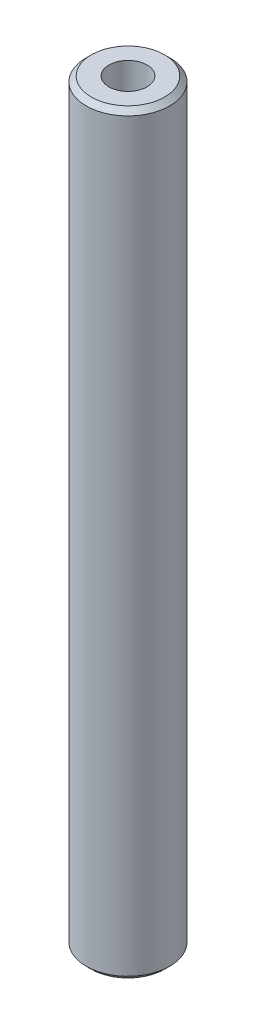
ISO-10303-21;
HEADER;
FILE_DESCRIPTION(('STEP AP214'),'2;1');
FILE_NAME('part.step','',(''),(''),'','','');
FILE_SCHEMA(('AUTOMOTIVE_DESIGN { 1 0 10303 214 1 1 1 1 }'));
ENDSEC;
DATA;
#1=APPLICATION_CONTEXT('core data for automotive mechanical design processes');
#2=APPLICATION_PROTOCOL_DEFINITION('international standard','automotive_design',2000,#1);
#3=PRODUCT_CONTEXT('',#1,'mechanical');
#4=PRODUCT('Part','Part','',(#3));
#5=PRODUCT_RELATED_PRODUCT_CATEGORY('part','',(#4));
#6=PRODUCT_DEFINITION_FORMATION('','',#4);
#7=PRODUCT_DEFINITION_CONTEXT('part definition',#1,'design');
#8=PRODUCT_DEFINITION('design','',#6,#7);
#9=PRODUCT_DEFINITION_SHAPE('','',#8);
#10=(LENGTH_UNIT() NAMED_UNIT(*) SI_UNIT(.MILLI.,.METRE.));
#11=(NAMED_UNIT(*) PLANE_ANGLE_UNIT() SI_UNIT($,.RADIAN.));
#12=(NAMED_UNIT(*) SI_UNIT($,.STERADIAN.) SOLID_ANGLE_UNIT());
#13=UNCERTAINTY_MEASURE_WITH_UNIT(LENGTH_MEASURE(1.E-05),#10,'distance_accuracy_value','');
#14=(GEOMETRIC_REPRESENTATION_CONTEXT(3) GLOBAL_UNCERTAINTY_ASSIGNED_CONTEXT((#13)) GLOBAL_UNIT_ASSIGNED_CONTEXT((#10,
#11,#12)) REPRESENTATION_CONTEXT('',''));
#15=CARTESIAN_POINT('',(0.,0.,0.));
#16=DIRECTION('',(0.,0.,1.));
#17=DIRECTION('',(1.,0.,0.));
#18=AXIS2_PLACEMENT_3D('',#15,#16,#17);
#19=CARTESIAN_POINT('',(0.,90.4105520086861,0.));
#20=DIRECTION('',(0.,-1.,0.));
#21=DIRECTION('',(0.,0.,-1.));
#22=AXIS2_PLACEMENT_3D('',#19,#20,#21);
#23=CYLINDRICAL_SURFACE('',#22,5.);
#24=CARTESIAN_POINT('',(0.,89.7965118532664,0.));
#25=DIRECTION('',(0.,1.,0.));
#26=DIRECTION('',(0.,0.,1.));
#27=AXIS2_PLACEMENT_3D('',#24,#25,#26);
#28=CIRCLE('',#27,5.);
#29=CARTESIAN_POINT('',(0.,89.7965118532664,5.));
#30=VERTEX_POINT('',#29);
#31=EDGE_CURVE('E50',#30,#30,#28,.F.);
#32=ORIENTED_EDGE('',*,*,#31,.T.);
#33=EDGE_LOOP('',(#32));
#34=FACE_BOUND('',#33,.T.);
#35=CARTESIAN_POINT('',(0.,0.614040155419673,0.));
#36=DIRECTION('',(0.,1.,0.));
#37=DIRECTION('',(0.,0.,1.));
#38=AXIS2_PLACEMENT_3D('',#35,#36,#37);
#39=CIRCLE('',#38,5.);
#40=CARTESIAN_POINT('',(0.,0.614040155419673,5.));
#41=VERTEX_POINT('',#40);
#42=EDGE_CURVE('E51',#41,#41,#39,.T.);
#43=ORIENTED_EDGE('',*,*,#42,.T.);
#44=EDGE_LOOP('',(#43));
#45=FACE_BOUND('',#44,.T.);
#46=ADVANCED_FACE('F39',(#34,#45),#23,.T.);
#47=CARTESIAN_POINT('',(0.,90.4105520086861,0.));
#48=DIRECTION('',(0.,1.,0.));
#49=DIRECTION('',(0.,0.,1.));
#50=AXIS2_PLACEMENT_3D('',#47,#48,#49);
#51=PLANE('',#50);
#52=CARTESIAN_POINT('',(0.,90.4105520086861,0.));
#53=DIRECTION('',(0.,1.,0.));
#54=DIRECTION('',(0.,0.,1.));
#55=AXIS2_PLACEMENT_3D('',#52,#53,#54);
#56=CIRCLE('',#55,4.38595984458036);
#57=CARTESIAN_POINT('',(0.,90.4105520086861,4.38595984458036));
#58=VERTEX_POINT('',#57);
#59=EDGE_CURVE('E54',#58,#58,#56,.T.);
#60=ORIENTED_EDGE('',*,*,#59,.T.);
#61=EDGE_LOOP('',(#60));
#62=FACE_BOUND('',#61,.T.);
#63=CARTESIAN_POINT('',(0.,90.4105520086861,0.));
#64=DIRECTION('',(0.,1.,0.));
#65=DIRECTION('',(0.,0.,1.));
#66=AXIS2_PLACEMENT_3D('',#63,#64,#65);
#67=CIRCLE('',#66,2.27778302262453);
#68=CARTESIAN_POINT('',(0.,90.4105520086861,2.27778302262453));
#69=VERTEX_POINT('',#68);
#70=EDGE_CURVE('E58',#69,#69,#67,.T.);
#71=ORIENTED_EDGE('',*,*,#70,.F.);
#72=EDGE_LOOP('',(#71));
#73=FACE_BOUND('',#72,.T.);
#74=ADVANCED_FACE('F69',(#62,#73),#51,.T.);
#75=CARTESIAN_POINT('',(0.,0.,0.));
#76=DIRECTION('',(0.,1.,0.));
#77=DIRECTION('',(0.,0.,1.));
#78=AXIS2_PLACEMENT_3D('',#75,#76,#77);
#79=PLANE('',#78);
#80=CARTESIAN_POINT('',(0.,0.,0.));
#81=DIRECTION('',(0.,1.,0.));
#82=DIRECTION('',(0.,0.,1.));
#83=AXIS2_PLACEMENT_3D('',#80,#81,#82);
#84=CIRCLE('',#83,4.38595984458032);
#85=CARTESIAN_POINT('',(0.,0.,4.38595984458032));
#86=VERTEX_POINT('',#85);
#87=EDGE_CURVE('E10',#86,#86,#84,.F.);
#88=ORIENTED_EDGE('',*,*,#87,.T.);
#89=EDGE_LOOP('',(#88));
#90=FACE_BOUND('',#89,.T.);
#91=CARTESIAN_POINT('',(0.,0.,0.));
#92=DIRECTION('',(0.,1.,0.));
#93=DIRECTION('',(0.,0.,1.));
#94=AXIS2_PLACEMENT_3D('',#91,#92,#93);
#95=CIRCLE('',#94,2.27778302262453);
#96=CARTESIAN_POINT('',(0.,0.,2.27778302262453));
#97=VERTEX_POINT('',#96);
#98=EDGE_CURVE('E63',#97,#97,#95,.T.);
#99=ORIENTED_EDGE('',*,*,#98,.T.);
#100=EDGE_LOOP('',(#99));
#101=FACE_BOUND('',#100,.T.);
#102=ADVANCED_FACE('F75',(#90,#101),#79,.F.);
#103=CARTESIAN_POINT('',(0.,90.4105520086861,0.));
#104=DIRECTION('',(0.,-1.,0.));
#105=DIRECTION('',(0.,0.,-1.));
#106=AXIS2_PLACEMENT_3D('',#103,#104,#105);
#107=CYLINDRICAL_SURFACE('',#106,2.27778302262453);
#108=ORIENTED_EDGE('',*,*,#70,.T.);
#109=EDGE_LOOP('',(#108));
#110=FACE_BOUND('',#109,.T.);
#111=ORIENTED_EDGE('',*,*,#98,.F.);
#112=EDGE_LOOP('',(#111));
#113=FACE_BOUND('',#112,.T.);
#114=ADVANCED_FACE('F70',(#110,#113),#107,.F.);
#115=CARTESIAN_POINT('',(0.,90.4105520086861,0.));
#116=DIRECTION('',(0.,-1.,0.));
#117=DIRECTION('',(0.,0.,-1.));
#118=AXIS2_PLACEMENT_3D('',#115,#116,#117);
#119=CONICAL_SURFACE('',#118,4.38595984458036,0.785398163397434);
#120=ORIENTED_EDGE('',*,*,#31,.F.);
#121=EDGE_LOOP('',(#120));
#122=FACE_BOUND('',#121,.T.);
#123=ORIENTED_EDGE('',*,*,#59,.F.);
#124=EDGE_LOOP('',(#123));
#125=FACE_BOUND('',#124,.T.);
#126=ADVANCED_FACE('F81',(#122,#125),#119,.T.);
#127=CARTESIAN_POINT('',(0.,0.614040155419673,0.));
#128=DIRECTION('',(0.,1.,0.));
#129=DIRECTION('',(0.,0.,1.));
#130=AXIS2_PLACEMENT_3D('',#127,#128,#129);
#131=CONICAL_SURFACE('',#130,5.,0.785398163397456);
#132=CARTESIAN_POINT('',(0.,0.,4.38595984458032));
#133=CARTESIAN_POINT('',(0.,0.00639625161895462,4.39235609619927));
#134=CARTESIAN_POINT('',(0.,0.0127925032379096,4.39875234781823));
#135=CARTESIAN_POINT('',(0.,0.0255850064758196,4.41154485105614));
#136=CARTESIAN_POINT('',(0.,0.0319812580947746,4.41794110267509));
#137=CARTESIAN_POINT('',(0.,0.0447737613326845,4.430733605913));
#138=CARTESIAN_POINT('',(0.,0.0511700129516394,4.43712985753196));
#139=CARTESIAN_POINT('',(0.,0.0639625161895492,4.44992236076987));
#140=CARTESIAN_POINT('',(0.,0.0703587678085041,4.45631861238882));
#141=CARTESIAN_POINT('',(0.,0.083151271046414,4.46911111562673));
#142=CARTESIAN_POINT('',(0.,0.0895475226653689,4.47550736724569));
#143=CARTESIAN_POINT('',(0.,0.102340025903279,4.4882998704836));
#144=CARTESIAN_POINT('',(0.,0.108736277522234,4.49469612210255));
#145=CARTESIAN_POINT('',(0.,0.121528780760144,4.50748862534046));
#146=CARTESIAN_POINT('',(0.,0.127925032379099,4.51388487695942));
#147=CARTESIAN_POINT('',(0.,0.140717535617008,4.52667738019733));
#148=CARTESIAN_POINT('',(0.,0.147113787235963,4.53307363181628));
#149=CARTESIAN_POINT('',(0.,0.159906290473873,4.54586613505419));
#150=CARTESIAN_POINT('',(0.,0.166302542092828,4.55226238667315));
#151=CARTESIAN_POINT('',(0.,0.179095045330738,4.56505488991106));
#152=CARTESIAN_POINT('',(0.,0.185491296949693,4.57145114153001));
#153=CARTESIAN_POINT('',(0.,0.198283800187603,4.58424364476792));
#154=CARTESIAN_POINT('',(0.,0.204680051806558,4.59063989638688));
#155=CARTESIAN_POINT('',(0.,0.217472555044468,4.60343239962479));
#156=CARTESIAN_POINT('',(0.,0.223868806663423,4.60982865124374));
#157=CARTESIAN_POINT('',(0.,0.236661309901332,4.62262115448165));
#158=CARTESIAN_POINT('',(0.,0.243057561520287,4.62901740610061));
#159=CARTESIAN_POINT('',(0.,0.255850064758197,4.64180990933852));
#160=CARTESIAN_POINT('',(0.,0.262246316377152,4.64820616095747));
#161=CARTESIAN_POINT('',(0.,0.275038819615062,4.66099866419538));
#162=CARTESIAN_POINT('',(0.,0.281435071234017,4.66739491581434));
#163=CARTESIAN_POINT('',(0.,0.294227574471927,4.68018741905225));
#164=CARTESIAN_POINT('',(0.,0.300623826090882,4.6865836706712));
#165=CARTESIAN_POINT('',(0.,0.313416329328792,4.69937617390911));
#166=CARTESIAN_POINT('',(0.,0.319812580947747,4.70577242552807));
#167=CARTESIAN_POINT('',(0.,0.332605084185656,4.71856492876598));
#168=CARTESIAN_POINT('',(0.,0.339001335804611,4.72496118038493));
#169=CARTESIAN_POINT('',(0.,0.351793839042521,4.73775368362284));
#170=CARTESIAN_POINT('',(0.,0.358190090661476,4.7441499352418));
#171=CARTESIAN_POINT('',(0.,0.370982593899386,4.75694243847971));
#172=CARTESIAN_POINT('',(0.,0.377378845518341,4.76333869009866));
#173=CARTESIAN_POINT('',(0.,0.390171348756251,4.77613119333657));
#174=CARTESIAN_POINT('',(0.,0.396567600375206,4.78252744495553));
#175=CARTESIAN_POINT('',(0.,0.409360103613116,4.79531994819344));
#176=CARTESIAN_POINT('',(0.,0.415756355232071,4.80171619981239));
#177=CARTESIAN_POINT('',(0.,0.42854885846998,4.8145087030503));
#178=CARTESIAN_POINT('',(0.,0.434945110088935,4.82090495466926));
#179=CARTESIAN_POINT('',(0.,0.447737613326845,4.83369745790717));
#180=CARTESIAN_POINT('',(0.,0.4541338649458,4.84009370952612));
#181=CARTESIAN_POINT('',(0.,0.46692636818371,4.85288621276403));
#182=CARTESIAN_POINT('',(0.,0.473322619802665,4.85928246438299));
#183=CARTESIAN_POINT('',(0.,0.486115123040575,4.8720749676209));
#184=CARTESIAN_POINT('',(0.,0.49251137465953,4.87847121923985));
#185=CARTESIAN_POINT('',(0.,0.50530387789744,4.89126372247777));
#186=CARTESIAN_POINT('',(0.,0.511700129516395,4.89765997409672));
#187=CARTESIAN_POINT('',(0.,0.524492632754304,4.91045247733463));
#188=CARTESIAN_POINT('',(0.,0.530888884373259,4.91684872895358));
#189=CARTESIAN_POINT('',(0.,0.543681387611169,4.92964123219149));
#190=CARTESIAN_POINT('',(0.,0.550077639230124,4.93603748381045));
#191=CARTESIAN_POINT('',(0.,0.562870142468034,4.94882998704836));
#192=CARTESIAN_POINT('',(0.,0.569266394086989,4.95522623866731));
#193=CARTESIAN_POINT('',(0.,0.582058897324899,4.96801874190523));
#194=CARTESIAN_POINT('',(0.,0.588455148943854,4.97441499352418));
#195=CARTESIAN_POINT('',(0.,0.601247652181764,4.98720749676209));
#196=CARTESIAN_POINT('',(0.,0.607643903800718,4.99360374838104));
#197=CARTESIAN_POINT('',(0.,0.614040155419673,5.));
#198=B_SPLINE_CURVE_WITH_KNOTS('',3,(#132,#133,#134,#135,#136,#137,#138,#139,#140,#141,#142,
#143,#144,#145,#146,#147,#148,#149,#150,#151,#152,#153,#154,#155,#156,#157,#158,#159,#160,#161,
#162,#163,#164,#165,#166,#167,#168,#169,#170,#171,#172,#173,#174,#175,#176,#177,#178,#179,#180,
#181,#182,#183,#184,#185,#186,#187,#188,#189,#190,#191,#192,#193,#194,#195,#196,#197),
.UNSPECIFIED.,.F.,.F.,(4,2,2,2,2,2,2,2,2,2,2,2,2,2,2,2,2,2,2,2,2,2,2,2,2,2,2,2,2,2,2,2,4),(0.,
0.0271369973636311,0.0542739947272616,0.0814109920908927,0.108547989454524,0.135684986818155,
0.162821984181786,0.189958981545417,0.217095978909048,0.244232976272679,0.27136997363631,
0.298506970999941,0.325643968363572,0.352780965727203,0.379917963090834,0.407054960454465,
0.434191957818096,0.461328955181727,0.488465952545358,0.515602949908989,0.54273994727262,
0.569876944636251,0.597013941999882,0.624150939363513,0.651287936727144,0.678424934090775,
0.705561931454406,0.732698928818037,0.759835926181668,0.786972923545299,0.81410992090893,
0.841246918272561,0.868383915636192),.UNSPECIFIED.);
#199=EDGE_CURVE('BSEAM45',#86,#41,#198,.T.);
#200=ORIENTED_EDGE('',*,*,#87,.F.);
#201=ORIENTED_EDGE('',*,*,#42,.F.);
#202=ORIENTED_EDGE('',*,*,#199,.T.);
#203=ORIENTED_EDGE('',*,*,#199,.F.);
#204=EDGE_LOOP('',(#200,#202,#201,#203));
#205=FACE_BOUND('',#204,.T.);
#206=ADVANCED_FACE('F45',(#205),#131,.T.);
#207=CLOSED_SHELL('',(#46,#74,#102,#114,#126,#206));
#208=MANIFOLD_SOLID_BREP('B2',#207);
#209=ADVANCED_BREP_SHAPE_REPRESENTATION('',(#18,#208),#14);
#210=SHAPE_DEFINITION_REPRESENTATION(#9,#209);
ENDSEC;
END-ISO-10303-21;
